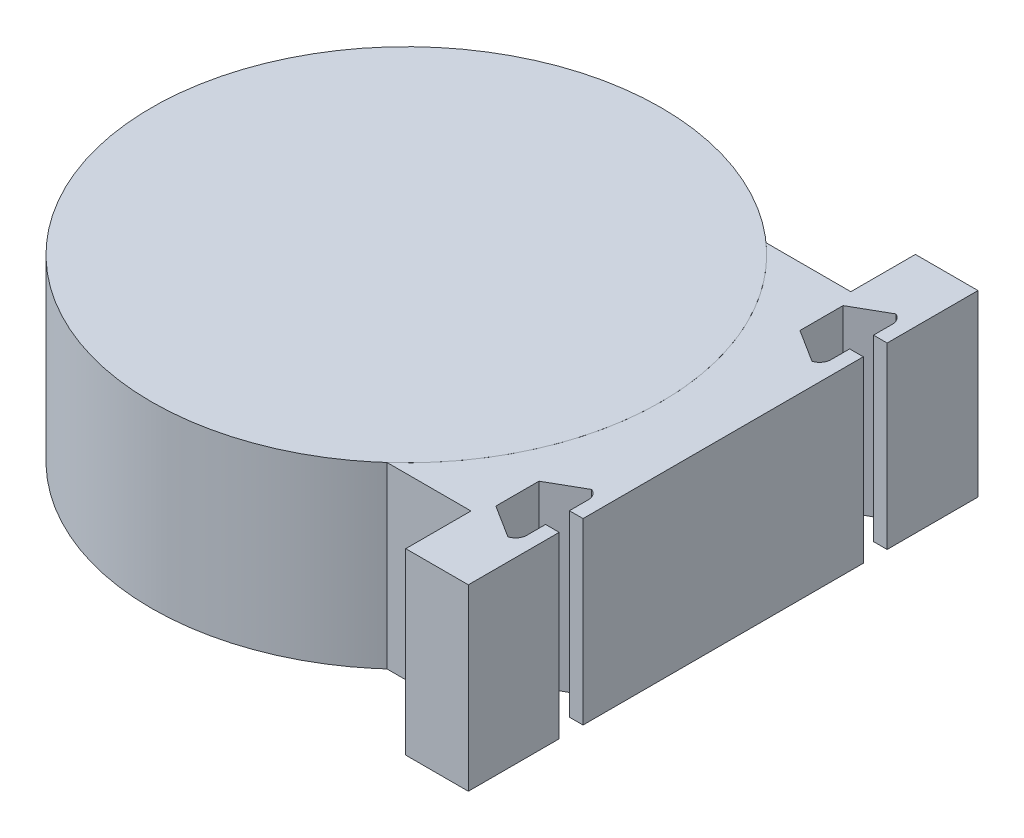
ISO-10303-21;
HEADER;
FILE_DESCRIPTION(('STEP AP214'),'2;1');
FILE_NAME('part.step','',(''),(''),'','','');
FILE_SCHEMA(('AUTOMOTIVE_DESIGN { 1 0 10303 214 1 1 1 1 }'));
ENDSEC;
DATA;
#1=APPLICATION_CONTEXT('core data for automotive mechanical design processes');
#2=APPLICATION_PROTOCOL_DEFINITION('international standard','automotive_design',2000,#1);
#3=PRODUCT_CONTEXT('',#1,'mechanical');
#4=PRODUCT('Part','Part','',(#3));
#5=PRODUCT_RELATED_PRODUCT_CATEGORY('part','',(#4));
#6=PRODUCT_DEFINITION_FORMATION('','',#4);
#7=PRODUCT_DEFINITION_CONTEXT('part definition',#1,'design');
#8=PRODUCT_DEFINITION('design','',#6,#7);
#9=PRODUCT_DEFINITION_SHAPE('','',#8);
#10=(LENGTH_UNIT() NAMED_UNIT(*) SI_UNIT(.MILLI.,.METRE.));
#11=(NAMED_UNIT(*) PLANE_ANGLE_UNIT() SI_UNIT($,.RADIAN.));
#12=(NAMED_UNIT(*) SI_UNIT($,.STERADIAN.) SOLID_ANGLE_UNIT());
#13=UNCERTAINTY_MEASURE_WITH_UNIT(LENGTH_MEASURE(1.E-05),#10,'distance_accuracy_value','');
#14=(GEOMETRIC_REPRESENTATION_CONTEXT(3) GLOBAL_UNCERTAINTY_ASSIGNED_CONTEXT((#13)) GLOBAL_UNIT_ASSIGNED_CONTEXT((#10,
#11,#12)) REPRESENTATION_CONTEXT('',''));
#15=CARTESIAN_POINT('',(0.,0.,0.));
#16=DIRECTION('',(0.,0.,1.));
#17=DIRECTION('',(1.,0.,0.));
#18=AXIS2_PLACEMENT_3D('',#15,#16,#17);
#19=CARTESIAN_POINT('',(35.4331913817621,0.,0.));
#20=DIRECTION('',(-1.,0.,0.));
#21=DIRECTION('',(0.,0.,1.));
#22=AXIS2_PLACEMENT_3D('',#19,#20,#21);
#23=PLANE('',#22);
#24=DIRECTION('',(0.,0.,1.));
#25=VECTOR('',#24,1.);
#26=CARTESIAN_POINT('',(35.4331913817621,20.,0.));
#27=LINE('',#26,#25);
#28=CARTESIAN_POINT('',(35.4331913817621,20.,-28.5));
#29=VERTEX_POINT('',#28);
#30=CARTESIAN_POINT('',(35.4331913817621,20.,-18.338));
#31=VERTEX_POINT('',#30);
#32=EDGE_CURVE('E255',#29,#31,#27,.T.);
#33=ORIENTED_EDGE('',*,*,#32,.T.);
#34=DIRECTION('',(0.,-1.,0.));
#35=VECTOR('',#34,1.);
#36=CARTESIAN_POINT('',(35.4331913817621,20.,-18.338));
#37=LINE('',#36,#35);
#38=CARTESIAN_POINT('',(35.4331913817621,0.,-18.338));
#39=VERTEX_POINT('',#38);
#40=EDGE_CURVE('E474',#31,#39,#37,.T.);
#41=ORIENTED_EDGE('',*,*,#40,.T.);
#42=DIRECTION('',(0.,0.,1.));
#43=VECTOR('',#42,1.);
#44=CARTESIAN_POINT('',(35.4331913817621,0.,0.));
#45=LINE('',#44,#43);
#46=CARTESIAN_POINT('',(35.4331913817621,0.,-28.5));
#47=VERTEX_POINT('',#46);
#48=EDGE_CURVE('E371',#47,#39,#45,.T.);
#49=ORIENTED_EDGE('',*,*,#48,.F.);
#50=DIRECTION('',(0.,1.,0.));
#51=VECTOR('',#50,1.);
#52=CARTESIAN_POINT('',(35.4331913817621,0.,-28.5));
#53=LINE('',#52,#51);
#54=EDGE_CURVE('E277',#47,#29,#53,.T.);
#55=ORIENTED_EDGE('',*,*,#54,.T.);
#56=EDGE_LOOP('',(#33,#41,#49,#55));
#57=FACE_BOUND('',#56,.T.);
#58=ADVANCED_FACE('F45',(#57),#23,.F.);
#59=CARTESIAN_POINT('',(35.4331913817621,0.,-15.671));
#60=VERTEX_POINT('',#59);
#61=CARTESIAN_POINT('',(35.4331913817621,0.,15.671));
#62=VERTEX_POINT('',#61);
#63=EDGE_CURVE('E247',#60,#62,#45,.T.);
#64=ORIENTED_EDGE('',*,*,#63,.F.);
#65=DIRECTION('',(0.,-1.,0.));
#66=VECTOR('',#65,1.);
#67=CARTESIAN_POINT('',(35.4331913817621,20.,-15.671));
#68=LINE('',#67,#66);
#69=CARTESIAN_POINT('',(35.4331913817621,20.,-15.671));
#70=VERTEX_POINT('',#69);
#71=EDGE_CURVE('E233',#70,#60,#68,.T.);
#72=ORIENTED_EDGE('',*,*,#71,.F.);
#73=CARTESIAN_POINT('',(35.4331913817621,20.,15.671));
#74=VERTEX_POINT('',#73);
#75=EDGE_CURVE('E245',#70,#74,#27,.T.);
#76=ORIENTED_EDGE('',*,*,#75,.T.);
#77=DIRECTION('',(0.,-1.,0.));
#78=VECTOR('',#77,1.);
#79=CARTESIAN_POINT('',(35.4331913817621,20.,15.671));
#80=LINE('',#79,#78);
#81=EDGE_CURVE('E331',#74,#62,#80,.T.);
#82=ORIENTED_EDGE('',*,*,#81,.T.);
#83=EDGE_LOOP('',(#64,#72,#76,#82));
#84=FACE_BOUND('',#83,.T.);
#85=ADVANCED_FACE('F243',(#84),#23,.F.);
#86=CARTESIAN_POINT('',(0.,0.,0.));
#87=DIRECTION('',(0.,1.,0.));
#88=DIRECTION('',(0.,0.,1.));
#89=AXIS2_PLACEMENT_3D('',#86,#87,#88);
#90=CYLINDRICAL_SURFACE('',#89,28.5);
#91=CARTESIAN_POINT('',(0.,20.,0.));
#92=DIRECTION('',(0.,1.,0.));
#93=DIRECTION('',(0.,0.,1.));
#94=AXIS2_PLACEMENT_3D('',#91,#92,#93);
#95=CIRCLE('',#94,28.5);
#96=CARTESIAN_POINT('',(19.046990751406,20.,21.200522241583));
#97=VERTEX_POINT('',#96);
#98=CARTESIAN_POINT('',(18.9614552412498,20.,-21.2770584229607));
#99=VERTEX_POINT('',#98);
#100=EDGE_CURVE('E359',#97,#99,#95,.T.);
#101=ORIENTED_EDGE('',*,*,#100,.T.);
#102=DIRECTION('',(0.,1.,0.));
#103=VECTOR('',#102,1.);
#104=CARTESIAN_POINT('',(18.9614552412498,0.,-21.2770584229607));
#105=LINE('',#104,#103);
#106=CARTESIAN_POINT('',(18.9614552412498,0.,-21.2770584229607));
#107=VERTEX_POINT('',#106);
#108=EDGE_CURVE('E270',#107,#99,#105,.T.);
#109=ORIENTED_EDGE('',*,*,#108,.F.);
#110=CARTESIAN_POINT('',(0.,0.,0.));
#111=DIRECTION('',(0.,1.,0.));
#112=DIRECTION('',(0.,0.,1.));
#113=AXIS2_PLACEMENT_3D('',#110,#111,#112);
#114=CIRCLE('',#113,28.5);
#115=CARTESIAN_POINT('',(19.046990751406,0.,21.200522241583));
#116=VERTEX_POINT('',#115);
#117=EDGE_CURVE('E269',#116,#107,#114,.T.);
#118=ORIENTED_EDGE('',*,*,#117,.F.);
#119=DIRECTION('',(0.,1.,0.));
#120=VECTOR('',#119,1.);
#121=CARTESIAN_POINT('',(19.046990751406,0.,21.200522241583));
#122=LINE('',#121,#120);
#123=EDGE_CURVE('E287',#116,#97,#122,.T.);
#124=ORIENTED_EDGE('',*,*,#123,.T.);
#125=EDGE_LOOP('',(#101,#109,#118,#124));
#126=FACE_BOUND('',#125,.T.);
#127=ADVANCED_FACE('F399',(#126),#90,.F.);
#128=CARTESIAN_POINT('',(0.,0.,-21.2770584229607));
#129=DIRECTION('',(0.,0.,-1.));
#130=DIRECTION('',(-1.,0.,0.));
#131=AXIS2_PLACEMENT_3D('',#128,#129,#130);
#132=PLANE('',#131);
#133=DIRECTION('',(-1.,0.,0.));
#134=VECTOR('',#133,1.);
#135=CARTESIAN_POINT('',(0.,20.,-21.2770584229607));
#136=LINE('',#135,#134);
#137=CARTESIAN_POINT('',(28.4331913817621,20.,-21.2770584229607));
#138=VERTEX_POINT('',#137);
#139=EDGE_CURVE('E266',#138,#99,#136,.T.);
#140=ORIENTED_EDGE('',*,*,#139,.F.);
#141=DIRECTION('',(0.,1.,0.));
#142=VECTOR('',#141,1.);
#143=CARTESIAN_POINT('',(28.4331913817621,0.,-21.2770584229607));
#144=LINE('',#143,#142);
#145=CARTESIAN_POINT('',(28.4331913817621,0.,-21.2770584229607));
#146=VERTEX_POINT('',#145);
#147=EDGE_CURVE('E273',#146,#138,#144,.T.);
#148=ORIENTED_EDGE('',*,*,#147,.F.);
#149=DIRECTION('',(-1.,0.,0.));
#150=VECTOR('',#149,1.);
#151=CARTESIAN_POINT('',(0.,0.,-21.2770584229607));
#152=LINE('',#151,#150);
#153=EDGE_CURVE('E290',#146,#107,#152,.T.);
#154=ORIENTED_EDGE('',*,*,#153,.T.);
#155=ORIENTED_EDGE('',*,*,#108,.T.);
#156=EDGE_LOOP('',(#140,#148,#154,#155));
#157=FACE_BOUND('',#156,.T.);
#158=ADVANCED_FACE('F393',(#157),#132,.T.);
#159=CARTESIAN_POINT('',(28.4331913817621,0.,0.));
#160=DIRECTION('',(-1.,0.,0.));
#161=DIRECTION('',(0.,0.,1.));
#162=AXIS2_PLACEMENT_3D('',#159,#160,#161);
#163=PLANE('',#162);
#164=DIRECTION('',(0.,0.,1.));
#165=VECTOR('',#164,1.);
#166=CARTESIAN_POINT('',(28.4331913817621,20.,0.));
#167=LINE('',#166,#165);
#168=CARTESIAN_POINT('',(28.4331913817621,20.,-28.5));
#169=VERTEX_POINT('',#168);
#170=EDGE_CURVE('E265',#169,#138,#167,.T.);
#171=ORIENTED_EDGE('',*,*,#170,.F.);
#172=DIRECTION('',(0.,1.,0.));
#173=VECTOR('',#172,1.);
#174=CARTESIAN_POINT('',(28.4331913817621,0.,-28.5));
#175=LINE('',#174,#173);
#176=CARTESIAN_POINT('',(28.4331913817621,0.,-28.5));
#177=VERTEX_POINT('',#176);
#178=EDGE_CURVE('E275',#177,#169,#175,.T.);
#179=ORIENTED_EDGE('',*,*,#178,.F.);
#180=DIRECTION('',(0.,0.,1.));
#181=VECTOR('',#180,1.);
#182=CARTESIAN_POINT('',(28.4331913817621,0.,0.));
#183=LINE('',#182,#181);
#184=EDGE_CURVE('E367',#177,#146,#183,.T.);
#185=ORIENTED_EDGE('',*,*,#184,.T.);
#186=ORIENTED_EDGE('',*,*,#147,.T.);
#187=EDGE_LOOP('',(#171,#179,#185,#186));
#188=FACE_BOUND('',#187,.T.);
#189=ADVANCED_FACE('F516',(#188),#163,.T.);
#190=CARTESIAN_POINT('',(0.,0.,-28.5));
#191=DIRECTION('',(0.,0.,1.));
#192=DIRECTION('',(1.,0.,0.));
#193=AXIS2_PLACEMENT_3D('',#190,#191,#192);
#194=PLANE('',#193);
#195=DIRECTION('',(1.,0.,0.));
#196=VECTOR('',#195,1.);
#197=CARTESIAN_POINT('',(0.,20.,-28.5));
#198=LINE('',#197,#196);
#199=EDGE_CURVE('E259',#169,#29,#198,.T.);
#200=ORIENTED_EDGE('',*,*,#199,.T.);
#201=ORIENTED_EDGE('',*,*,#54,.F.);
#202=DIRECTION('',(1.,0.,0.));
#203=VECTOR('',#202,1.);
#204=CARTESIAN_POINT('',(0.,0.,-28.5));
#205=LINE('',#204,#203);
#206=EDGE_CURVE('E373',#177,#47,#205,.T.);
#207=ORIENTED_EDGE('',*,*,#206,.F.);
#208=ORIENTED_EDGE('',*,*,#178,.T.);
#209=EDGE_LOOP('',(#200,#201,#207,#208));
#210=FACE_BOUND('',#209,.T.);
#211=ADVANCED_FACE('F514',(#210),#194,.F.);
#212=CARTESIAN_POINT('',(35.4331913817621,0.,18.338));
#213=VERTEX_POINT('',#212);
#214=CARTESIAN_POINT('',(35.4331913817621,0.,28.5));
#215=VERTEX_POINT('',#214);
#216=EDGE_CURVE('E370',#213,#215,#45,.T.);
#217=ORIENTED_EDGE('',*,*,#216,.F.);
#218=DIRECTION('',(0.,-1.,0.));
#219=VECTOR('',#218,1.);
#220=CARTESIAN_POINT('',(35.4331913817621,20.,18.338));
#221=LINE('',#220,#219);
#222=CARTESIAN_POINT('',(35.4331913817621,20.,18.338));
#223=VERTEX_POINT('',#222);
#224=EDGE_CURVE('E345',#223,#213,#221,.T.);
#225=ORIENTED_EDGE('',*,*,#224,.F.);
#226=CARTESIAN_POINT('',(35.4331913817621,20.,28.5));
#227=VERTEX_POINT('',#226);
#228=EDGE_CURVE('E256',#223,#227,#27,.T.);
#229=ORIENTED_EDGE('',*,*,#228,.T.);
#230=DIRECTION('',(0.,1.,0.));
#231=VECTOR('',#230,1.);
#232=CARTESIAN_POINT('',(35.4331913817621,0.,28.5));
#233=LINE('',#232,#231);
#234=EDGE_CURVE('E280',#215,#227,#233,.T.);
#235=ORIENTED_EDGE('',*,*,#234,.F.);
#236=EDGE_LOOP('',(#217,#225,#229,#235));
#237=FACE_BOUND('',#236,.T.);
#238=ADVANCED_FACE('F418',(#237),#23,.F.);
#239=CARTESIAN_POINT('',(0.,0.,28.5));
#240=DIRECTION('',(0.,0.,1.));
#241=DIRECTION('',(1.,0.,0.));
#242=AXIS2_PLACEMENT_3D('',#239,#240,#241);
#243=PLANE('',#242);
#244=DIRECTION('',(1.,0.,0.));
#245=VECTOR('',#244,1.);
#246=CARTESIAN_POINT('',(0.,20.,28.5));
#247=LINE('',#246,#245);
#248=CARTESIAN_POINT('',(28.4331913817621,20.,28.5));
#249=VERTEX_POINT('',#248);
#250=EDGE_CURVE('E260',#249,#227,#247,.T.);
#251=ORIENTED_EDGE('',*,*,#250,.F.);
#252=DIRECTION('',(0.,1.,0.));
#253=VECTOR('',#252,1.);
#254=CARTESIAN_POINT('',(28.4331913817621,0.,28.5));
#255=LINE('',#254,#253);
#256=CARTESIAN_POINT('',(28.4331913817621,0.,28.5));
#257=VERTEX_POINT('',#256);
#258=EDGE_CURVE('E283',#257,#249,#255,.T.);
#259=ORIENTED_EDGE('',*,*,#258,.F.);
#260=DIRECTION('',(1.,0.,0.));
#261=VECTOR('',#260,1.);
#262=CARTESIAN_POINT('',(0.,0.,28.5));
#263=LINE('',#262,#261);
#264=EDGE_CURVE('E366',#257,#215,#263,.T.);
#265=ORIENTED_EDGE('',*,*,#264,.T.);
#266=ORIENTED_EDGE('',*,*,#234,.T.);
#267=EDGE_LOOP('',(#251,#259,#265,#266));
#268=FACE_BOUND('',#267,.T.);
#269=ADVANCED_FACE('F409',(#268),#243,.T.);
#270=CARTESIAN_POINT('',(28.4331913817621,20.,21.200522241583));
#271=VERTEX_POINT('',#270);
#272=EDGE_CURVE('E380',#271,#249,#167,.T.);
#273=ORIENTED_EDGE('',*,*,#272,.F.);
#274=DIRECTION('',(0.,1.,0.));
#275=VECTOR('',#274,1.);
#276=CARTESIAN_POINT('',(28.4331913817621,0.,21.200522241583));
#277=LINE('',#276,#275);
#278=CARTESIAN_POINT('',(28.4331913817621,0.,21.200522241583));
#279=VERTEX_POINT('',#278);
#280=EDGE_CURVE('E285',#279,#271,#277,.T.);
#281=ORIENTED_EDGE('',*,*,#280,.F.);
#282=EDGE_CURVE('E363',#279,#257,#183,.T.);
#283=ORIENTED_EDGE('',*,*,#282,.T.);
#284=ORIENTED_EDGE('',*,*,#258,.T.);
#285=EDGE_LOOP('',(#273,#281,#283,#284));
#286=FACE_BOUND('',#285,.T.);
#287=ADVANCED_FACE('F403',(#286),#163,.T.);
#288=CARTESIAN_POINT('',(0.,0.,21.200522241583));
#289=DIRECTION('',(0.,0.,-1.));
#290=DIRECTION('',(-1.,0.,0.));
#291=AXIS2_PLACEMENT_3D('',#288,#289,#290);
#292=PLANE('',#291);
#293=DIRECTION('',(-1.,0.,0.));
#294=VECTOR('',#293,1.);
#295=CARTESIAN_POINT('',(0.,20.,21.200522241583));
#296=LINE('',#295,#294);
#297=EDGE_CURVE('E379',#271,#97,#296,.T.);
#298=ORIENTED_EDGE('',*,*,#297,.T.);
#299=ORIENTED_EDGE('',*,*,#123,.F.);
#300=DIRECTION('',(-1.,0.,0.));
#301=VECTOR('',#300,1.);
#302=CARTESIAN_POINT('',(0.,0.,21.200522241583));
#303=LINE('',#302,#301);
#304=EDGE_CURVE('E361',#279,#116,#303,.T.);
#305=ORIENTED_EDGE('',*,*,#304,.F.);
#306=ORIENTED_EDGE('',*,*,#280,.T.);
#307=EDGE_LOOP('',(#298,#299,#305,#306));
#308=FACE_BOUND('',#307,.T.);
#309=ADVANCED_FACE('F517',(#308),#292,.F.);
#310=CARTESIAN_POINT('',(0.,0.,0.));
#311=DIRECTION('',(0.,1.,0.));
#312=DIRECTION('',(0.,0.,1.));
#313=AXIS2_PLACEMENT_3D('',#310,#311,#312);
#314=PLANE('',#313);
#315=ORIENTED_EDGE('',*,*,#48,.T.);
#316=DIRECTION('',(1.,0.,0.));
#317=VECTOR('',#316,1.);
#318=CARTESIAN_POINT('',(33.9091913817621,0.,-18.338));
#319=LINE('',#318,#317);
#320=CARTESIAN_POINT('',(33.9091913817621,0.,-18.338));
#321=VERTEX_POINT('',#320);
#322=EDGE_CURVE('E239',#321,#39,#319,.T.);
#323=ORIENTED_EDGE('',*,*,#322,.F.);
#324=DIRECTION('',(0.,0.,1.));
#325=VECTOR('',#324,1.);
#326=CARTESIAN_POINT('',(33.9091913817621,0.,-21.64));
#327=LINE('',#326,#325);
#328=CARTESIAN_POINT('',(33.9091913817621,0.,-20.4546186460821));
#329=VERTEX_POINT('',#328);
#330=EDGE_CURVE('E471',#329,#321,#327,.T.);
#331=ORIENTED_EDGE('',*,*,#330,.F.);
#332=CARTESIAN_POINT('',(32.6391913817621,0.,-20.4546186460821));
#333=DIRECTION('',(0.,1.,0.));
#334=DIRECTION('',(0.,0.,1.));
#335=AXIS2_PLACEMENT_3D('',#332,#333,#334);
#336=CIRCLE('',#335,1.27);
#337=CARTESIAN_POINT('',(33.0950104750257,0.,-21.64));
#338=VERTEX_POINT('',#337);
#339=EDGE_CURVE('E299',#329,#338,#336,.T.);
#340=ORIENTED_EDGE('',*,*,#339,.T.);
#341=DIRECTION('',(0.868214773496011,0.,-0.496188580162089));
#342=VECTOR('',#341,1.);
#343=CARTESIAN_POINT('',(29.34605908307,0.,-19.4974577108601));
#344=LINE('',#343,#342);
#345=CARTESIAN_POINT('',(29.34605908307,0.,-19.4974577108601));
#346=VERTEX_POINT('',#345);
#347=EDGE_CURVE('E468',#346,#338,#344,.T.);
#348=ORIENTED_EDGE('',*,*,#347,.F.);
#349=DIRECTION('',(0.,0.,-1.));
#350=VECTOR('',#349,1.);
#351=CARTESIAN_POINT('',(29.34605908307,0.,-14.6714577108601));
#352=LINE('',#351,#350);
#353=CARTESIAN_POINT('',(29.34605908307,0.,-14.6714577108601));
#354=VERTEX_POINT('',#353);
#355=EDGE_CURVE('E465',#354,#346,#352,.T.);
#356=ORIENTED_EDGE('',*,*,#355,.F.);
#357=DIRECTION('',(-0.84597460686771,0.,-0.533223184543792));
#358=VECTOR('',#357,1.);
#359=CARTESIAN_POINT('',(32.9989774355247,0.,-12.369));
#360=LINE('',#359,#358);
#361=CARTESIAN_POINT('',(32.9989774355247,0.,-12.369));
#362=VERTEX_POINT('',#361);
#363=EDGE_CURVE('E458',#362,#354,#360,.T.);
#364=ORIENTED_EDGE('',*,*,#363,.F.);
#365=CARTESIAN_POINT('',(32.6391913817621,0.,-13.5869712621888));
#366=DIRECTION('',(0.,1.,0.));
#367=DIRECTION('',(0.,0.,1.));
#368=AXIS2_PLACEMENT_3D('',#365,#366,#367);
#369=CIRCLE('',#368,1.27);
#370=CARTESIAN_POINT('',(33.9091913817621,0.,-13.5869712621888));
#371=VERTEX_POINT('',#370);
#372=EDGE_CURVE('E303',#362,#371,#369,.T.);
#373=ORIENTED_EDGE('',*,*,#372,.T.);
#374=DIRECTION('',(0.,0.,1.));
#375=VECTOR('',#374,1.);
#376=CARTESIAN_POINT('',(33.9091913817621,0.,-15.671));
#377=LINE('',#376,#375);
#378=CARTESIAN_POINT('',(33.9091913817621,0.,-15.671));
#379=VERTEX_POINT('',#378);
#380=EDGE_CURVE('E456',#379,#371,#377,.T.);
#381=ORIENTED_EDGE('',*,*,#380,.F.);
#382=DIRECTION('',(-1.,0.,0.));
#383=VECTOR('',#382,1.);
#384=CARTESIAN_POINT('',(35.4331913817621,0.,-15.671));
#385=LINE('',#384,#383);
#386=EDGE_CURVE('E454',#60,#379,#385,.T.);
#387=ORIENTED_EDGE('',*,*,#386,.F.);
#388=ORIENTED_EDGE('',*,*,#63,.T.);
#389=DIRECTION('',(-1.,0.,0.));
#390=VECTOR('',#389,1.);
#391=CARTESIAN_POINT('',(0.,0.,15.671));
#392=LINE('',#391,#390);
#393=CARTESIAN_POINT('',(33.9091913817621,0.,15.671));
#394=VERTEX_POINT('',#393);
#395=EDGE_CURVE('E357',#62,#394,#392,.T.);
#396=ORIENTED_EDGE('',*,*,#395,.T.);
#397=DIRECTION('',(0.,0.,-1.));
#398=VECTOR('',#397,1.);
#399=CARTESIAN_POINT('',(33.9091913817621,0.,0.));
#400=LINE('',#399,#398);
#401=CARTESIAN_POINT('',(33.9091913817621,0.,13.5543813539179));
#402=VERTEX_POINT('',#401);
#403=EDGE_CURVE('E319',#394,#402,#400,.T.);
#404=ORIENTED_EDGE('',*,*,#403,.T.);
#405=CARTESIAN_POINT('',(32.6391913817621,0.,13.5543813539179));
#406=DIRECTION('',(0.,1.,0.));
#407=DIRECTION('',(0.,0.,1.));
#408=AXIS2_PLACEMENT_3D('',#405,#406,#407);
#409=CIRCLE('',#408,1.27);
#410=CARTESIAN_POINT('',(33.0950104750257,0.,12.369));
#411=VERTEX_POINT('',#410);
#412=EDGE_CURVE('E53',#402,#411,#409,.T.);
#413=ORIENTED_EDGE('',*,*,#412,.T.);
#414=DIRECTION('',(-0.868214773496011,0.,0.49618858016209));
#415=VECTOR('',#414,1.);
#416=CARTESIAN_POINT('',(13.4766380331124,0.,23.5809865547171));
#417=LINE('',#416,#415);
#418=CARTESIAN_POINT('',(29.34605908307,0.,14.5115422891399));
#419=VERTEX_POINT('',#418);
#420=EDGE_CURVE('E317',#411,#419,#417,.T.);
#421=ORIENTED_EDGE('',*,*,#420,.T.);
#422=DIRECTION('',(0.,0.,1.));
#423=VECTOR('',#422,1.);
#424=CARTESIAN_POINT('',(29.34605908307,0.,0.));
#425=LINE('',#424,#423);
#426=CARTESIAN_POINT('',(29.34605908307,0.,19.3375422891399));
#427=VERTEX_POINT('',#426);
#428=EDGE_CURVE('E326',#419,#427,#425,.T.);
#429=ORIENTED_EDGE('',*,*,#428,.T.);
#430=DIRECTION('',(0.84597460686771,0.,0.533223184543793));
#431=VECTOR('',#430,1.);
#432=CARTESIAN_POINT('',(-0.37915936056536,0.,0.601547720151972));
#433=LINE('',#432,#431);
#434=CARTESIAN_POINT('',(32.9989774355247,0.,21.64));
#435=VERTEX_POINT('',#434);
#436=EDGE_CURVE('E352',#427,#435,#433,.T.);
#437=ORIENTED_EDGE('',*,*,#436,.T.);
#438=CARTESIAN_POINT('',(32.6391913817621,0.,20.4220287378111));
#439=DIRECTION('',(0.,1.,0.));
#440=DIRECTION('',(0.,0.,1.));
#441=AXIS2_PLACEMENT_3D('',#438,#439,#440);
#442=CIRCLE('',#441,1.27);
#443=CARTESIAN_POINT('',(33.9091913817621,0.,20.4220287378111));
#444=VERTEX_POINT('',#443);
#445=EDGE_CURVE('E307',#435,#444,#442,.T.);
#446=ORIENTED_EDGE('',*,*,#445,.T.);
#447=DIRECTION('',(0.,0.,-1.));
#448=VECTOR('',#447,1.);
#449=CARTESIAN_POINT('',(33.9091913817621,0.,0.));
#450=LINE('',#449,#448);
#451=CARTESIAN_POINT('',(33.9091913817621,0.,18.338));
#452=VERTEX_POINT('',#451);
#453=EDGE_CURVE('E350',#444,#452,#450,.T.);
#454=ORIENTED_EDGE('',*,*,#453,.T.);
#455=DIRECTION('',(1.,0.,0.));
#456=VECTOR('',#455,1.);
#457=CARTESIAN_POINT('',(0.,0.,18.338));
#458=LINE('',#457,#456);
#459=EDGE_CURVE('E347',#452,#213,#458,.T.);
#460=ORIENTED_EDGE('',*,*,#459,.T.);
#461=ORIENTED_EDGE('',*,*,#216,.T.);
#462=ORIENTED_EDGE('',*,*,#264,.F.);
#463=ORIENTED_EDGE('',*,*,#282,.F.);
#464=ORIENTED_EDGE('',*,*,#304,.T.);
#465=ORIENTED_EDGE('',*,*,#117,.T.);
#466=ORIENTED_EDGE('',*,*,#153,.F.);
#467=ORIENTED_EDGE('',*,*,#184,.F.);
#468=ORIENTED_EDGE('',*,*,#206,.T.);
#469=EDGE_LOOP('',(#315,#323,#331,#340,#348,#356,#364,#373,#381,#387,#388,#396,#404,#413,#421,
#429,#437,#446,#454,#460,#461,#462,#463,#464,#465,#466,#467,#468));
#470=FACE_BOUND('',#469,.T.);
#471=ADVANCED_FACE('F315',(#470),#314,.F.);
#472=CARTESIAN_POINT('',(0.,20.,0.));
#473=DIRECTION('',(0.,1.,0.));
#474=DIRECTION('',(0.,0.,1.));
#475=AXIS2_PLACEMENT_3D('',#472,#473,#474);
#476=PLANE('',#475);
#477=DIRECTION('',(1.,0.,0.));
#478=VECTOR('',#477,1.);
#479=CARTESIAN_POINT('',(33.9091913817621,20.,-18.338));
#480=LINE('',#479,#478);
#481=CARTESIAN_POINT('',(33.9091913817621,20.,-18.338));
#482=VERTEX_POINT('',#481);
#483=EDGE_CURVE('E248',#482,#31,#480,.T.);
#484=ORIENTED_EDGE('',*,*,#483,.T.);
#485=ORIENTED_EDGE('',*,*,#32,.F.);
#486=ORIENTED_EDGE('',*,*,#199,.F.);
#487=ORIENTED_EDGE('',*,*,#170,.T.);
#488=ORIENTED_EDGE('',*,*,#139,.T.);
#489=ORIENTED_EDGE('',*,*,#100,.F.);
#490=ORIENTED_EDGE('',*,*,#297,.F.);
#491=ORIENTED_EDGE('',*,*,#272,.T.);
#492=ORIENTED_EDGE('',*,*,#250,.T.);
#493=ORIENTED_EDGE('',*,*,#228,.F.);
#494=DIRECTION('',(-1.,0.,0.));
#495=VECTOR('',#494,1.);
#496=CARTESIAN_POINT('',(35.4331913817621,20.,18.338));
#497=LINE('',#496,#495);
#498=CARTESIAN_POINT('',(33.9091913817621,20.,18.338));
#499=VERTEX_POINT('',#498);
#500=EDGE_CURVE('E414',#223,#499,#497,.T.);
#501=ORIENTED_EDGE('',*,*,#500,.T.);
#502=DIRECTION('',(0.,0.,1.));
#503=VECTOR('',#502,1.);
#504=CARTESIAN_POINT('',(33.9091913817621,20.,18.338));
#505=LINE('',#504,#503);
#506=CARTESIAN_POINT('',(33.9091913817621,20.,20.4220287378111));
#507=VERTEX_POINT('',#506);
#508=EDGE_CURVE('E435',#499,#507,#505,.T.);
#509=ORIENTED_EDGE('',*,*,#508,.T.);
#510=CARTESIAN_POINT('',(32.6391913817621,20.,20.4220287378111));
#511=DIRECTION('',(0.,1.,0.));
#512=DIRECTION('',(0.,0.,1.));
#513=AXIS2_PLACEMENT_3D('',#510,#511,#512);
#514=CIRCLE('',#513,1.27);
#515=CARTESIAN_POINT('',(32.9989774355247,20.,21.64));
#516=VERTEX_POINT('',#515);
#517=EDGE_CURVE('E309',#507,#516,#514,.F.);
#518=ORIENTED_EDGE('',*,*,#517,.T.);
#519=DIRECTION('',(-0.84597460686771,0.,-0.533223184543793));
#520=VECTOR('',#519,1.);
#521=CARTESIAN_POINT('',(32.9989774355247,20.,21.64));
#522=LINE('',#521,#520);
#523=CARTESIAN_POINT('',(29.34605908307,20.,19.3375422891399));
#524=VERTEX_POINT('',#523);
#525=EDGE_CURVE('E434',#516,#524,#522,.T.);
#526=ORIENTED_EDGE('',*,*,#525,.T.);
#527=DIRECTION('',(0.,0.,-1.));
#528=VECTOR('',#527,1.);
#529=CARTESIAN_POINT('',(29.34605908307,20.,19.3375422891399));
#530=LINE('',#529,#528);
#531=CARTESIAN_POINT('',(29.34605908307,20.,14.5115422891399));
#532=VERTEX_POINT('',#531);
#533=EDGE_CURVE('E439',#524,#532,#530,.T.);
#534=ORIENTED_EDGE('',*,*,#533,.T.);
#535=DIRECTION('',(0.868214773496011,0.,-0.49618858016209));
#536=VECTOR('',#535,1.);
#537=CARTESIAN_POINT('',(29.34605908307,20.,14.5115422891399));
#538=LINE('',#537,#536);
#539=CARTESIAN_POINT('',(33.0950104750257,20.,12.369));
#540=VERTEX_POINT('',#539);
#541=EDGE_CURVE('E441',#532,#540,#538,.T.);
#542=ORIENTED_EDGE('',*,*,#541,.T.);
#543=CARTESIAN_POINT('',(32.6391913817621,20.,13.5543813539179));
#544=DIRECTION('',(0.,1.,0.));
#545=DIRECTION('',(0.,0.,1.));
#546=AXIS2_PLACEMENT_3D('',#543,#544,#545);
#547=CIRCLE('',#546,1.27);
#548=CARTESIAN_POINT('',(33.9091913817621,20.,13.5543813539179));
#549=VERTEX_POINT('',#548);
#550=EDGE_CURVE('E12',#540,#549,#547,.F.);
#551=ORIENTED_EDGE('',*,*,#550,.T.);
#552=DIRECTION('',(0.,0.,1.));
#553=VECTOR('',#552,1.);
#554=CARTESIAN_POINT('',(33.9091913817621,20.,12.369));
#555=LINE('',#554,#553);
#556=CARTESIAN_POINT('',(33.9091913817621,20.,15.671));
#557=VERTEX_POINT('',#556);
#558=EDGE_CURVE('E447',#549,#557,#555,.T.);
#559=ORIENTED_EDGE('',*,*,#558,.T.);
#560=DIRECTION('',(1.,0.,0.));
#561=VECTOR('',#560,1.);
#562=CARTESIAN_POINT('',(33.9091913817621,20.,15.671));
#563=LINE('',#562,#561);
#564=EDGE_CURVE('E254',#557,#74,#563,.T.);
#565=ORIENTED_EDGE('',*,*,#564,.T.);
#566=ORIENTED_EDGE('',*,*,#75,.F.);
#567=DIRECTION('',(-1.,0.,0.));
#568=VECTOR('',#567,1.);
#569=CARTESIAN_POINT('',(35.4331913817621,20.,-15.671));
#570=LINE('',#569,#568);
#571=CARTESIAN_POINT('',(33.9091913817621,20.,-15.671));
#572=VERTEX_POINT('',#571);
#573=EDGE_CURVE('E229',#70,#572,#570,.T.);
#574=ORIENTED_EDGE('',*,*,#573,.T.);
#575=DIRECTION('',(0.,0.,1.));
#576=VECTOR('',#575,1.);
#577=CARTESIAN_POINT('',(33.9091913817621,20.,-15.671));
#578=LINE('',#577,#576);
#579=CARTESIAN_POINT('',(33.9091913817621,20.,-13.5869712621888));
#580=VERTEX_POINT('',#579);
#581=EDGE_CURVE('E238',#572,#580,#578,.T.);
#582=ORIENTED_EDGE('',*,*,#581,.T.);
#583=CARTESIAN_POINT('',(32.6391913817621,20.,-13.5869712621888));
#584=DIRECTION('',(0.,1.,0.));
#585=DIRECTION('',(0.,0.,1.));
#586=AXIS2_PLACEMENT_3D('',#583,#584,#585);
#587=CIRCLE('',#586,1.27);
#588=CARTESIAN_POINT('',(32.9989774355247,20.,-12.369));
#589=VERTEX_POINT('',#588);
#590=EDGE_CURVE('E305',#580,#589,#587,.F.);
#591=ORIENTED_EDGE('',*,*,#590,.T.);
#592=DIRECTION('',(-0.84597460686771,0.,-0.533223184543792));
#593=VECTOR('',#592,1.);
#594=CARTESIAN_POINT('',(32.9989774355247,20.,-12.369));
#595=LINE('',#594,#593);
#596=CARTESIAN_POINT('',(29.34605908307,20.,-14.6714577108601));
#597=VERTEX_POINT('',#596);
#598=EDGE_CURVE('E494',#589,#597,#595,.T.);
#599=ORIENTED_EDGE('',*,*,#598,.T.);
#600=DIRECTION('',(0.,0.,-1.));
#601=VECTOR('',#600,1.);
#602=CARTESIAN_POINT('',(29.34605908307,20.,-14.6714577108601));
#603=LINE('',#602,#601);
#604=CARTESIAN_POINT('',(29.34605908307,20.,-19.4974577108601));
#605=VERTEX_POINT('',#604);
#606=EDGE_CURVE('E497',#597,#605,#603,.T.);
#607=ORIENTED_EDGE('',*,*,#606,.T.);
#608=DIRECTION('',(0.868214773496011,0.,-0.496188580162089));
#609=VECTOR('',#608,1.);
#610=CARTESIAN_POINT('',(29.34605908307,20.,-19.4974577108601));
#611=LINE('',#610,#609);
#612=CARTESIAN_POINT('',(33.0950104750257,20.,-21.64));
#613=VERTEX_POINT('',#612);
#614=EDGE_CURVE('E502',#605,#613,#611,.T.);
#615=ORIENTED_EDGE('',*,*,#614,.T.);
#616=CARTESIAN_POINT('',(32.6391913817621,20.,-20.4546186460821));
#617=DIRECTION('',(0.,1.,0.));
#618=DIRECTION('',(0.,0.,1.));
#619=AXIS2_PLACEMENT_3D('',#616,#617,#618);
#620=CIRCLE('',#619,1.27);
#621=CARTESIAN_POINT('',(33.9091913817621,20.,-20.4546186460821));
#622=VERTEX_POINT('',#621);
#623=EDGE_CURVE('E301',#613,#622,#620,.F.);
#624=ORIENTED_EDGE('',*,*,#623,.T.);
#625=DIRECTION('',(0.,0.,1.));
#626=VECTOR('',#625,1.);
#627=CARTESIAN_POINT('',(33.9091913817621,20.,-21.64));
#628=LINE('',#627,#626);
#629=EDGE_CURVE('E504',#622,#482,#628,.T.);
#630=ORIENTED_EDGE('',*,*,#629,.T.);
#631=EDGE_LOOP('',(#484,#485,#486,#487,#488,#489,#490,#491,#492,#493,#501,#509,#518,#526,#534,
#542,#551,#559,#565,#566,#574,#582,#591,#599,#607,#615,#624,#630));
#632=FACE_BOUND('',#631,.T.);
#633=ADVANCED_FACE('F252',(#632),#476,.T.);
#634=CARTESIAN_POINT('',(33.9091913817621,20.,15.671));
#635=DIRECTION('',(0.,0.,-1.));
#636=DIRECTION('',(-1.,0.,0.));
#637=AXIS2_PLACEMENT_3D('',#634,#635,#636);
#638=PLANE('',#637);
#639=ORIENTED_EDGE('',*,*,#81,.F.);
#640=ORIENTED_EDGE('',*,*,#564,.F.);
#641=DIRECTION('',(0.,-1.,0.));
#642=VECTOR('',#641,1.);
#643=CARTESIAN_POINT('',(33.9091913817621,20.,15.671));
#644=LINE('',#643,#642);
#645=EDGE_CURVE('E328',#557,#394,#644,.T.);
#646=ORIENTED_EDGE('',*,*,#645,.T.);
#647=ORIENTED_EDGE('',*,*,#395,.F.);
#648=EDGE_LOOP('',(#639,#640,#646,#647));
#649=FACE_BOUND('',#648,.T.);
#650=ADVANCED_FACE('F451',(#649),#638,.F.);
#651=CARTESIAN_POINT('',(33.9091913817621,20.,12.369));
#652=DIRECTION('',(1.,0.,0.));
#653=DIRECTION('',(0.,0.,-1.));
#654=AXIS2_PLACEMENT_3D('',#651,#652,#653);
#655=PLANE('',#654);
#656=ORIENTED_EDGE('',*,*,#558,.F.);
#657=DIRECTION('',(0.,1.,0.));
#658=VECTOR('',#657,1.);
#659=CARTESIAN_POINT('',(33.9091913817621,20.,13.5543813539179));
#660=LINE('',#659,#658);
#661=EDGE_CURVE('E297',#549,#402,#660,.F.);
#662=ORIENTED_EDGE('',*,*,#661,.T.);
#663=ORIENTED_EDGE('',*,*,#403,.F.);
#664=ORIENTED_EDGE('',*,*,#645,.F.);
#665=EDGE_LOOP('',(#656,#662,#663,#664));
#666=FACE_BOUND('',#665,.T.);
#667=ADVANCED_FACE('F560',(#666),#655,.F.);
#668=CARTESIAN_POINT('',(29.34605908307,20.,14.5115422891399));
#669=DIRECTION('',(-0.49618858016209,0.,-0.868214773496011));
#670=DIRECTION('',(-0.868214773496011,0.,0.49618858016209));
#671=AXIS2_PLACEMENT_3D('',#668,#669,#670);
#672=PLANE('',#671);
#673=DIRECTION('',(0.,-1.,0.));
#674=VECTOR('',#673,1.);
#675=CARTESIAN_POINT('',(33.0950104750257,20.,12.369));
#676=LINE('',#675,#674);
#677=EDGE_CURVE('E324',#540,#411,#676,.T.);
#678=ORIENTED_EDGE('',*,*,#677,.F.);
#679=ORIENTED_EDGE('',*,*,#541,.F.);
#680=DIRECTION('',(0.,-1.,0.));
#681=VECTOR('',#680,1.);
#682=CARTESIAN_POINT('',(29.34605908307,20.,14.5115422891399));
#683=LINE('',#682,#681);
#684=EDGE_CURVE('E325',#532,#419,#683,.T.);
#685=ORIENTED_EDGE('',*,*,#684,.T.);
#686=ORIENTED_EDGE('',*,*,#420,.F.);
#687=EDGE_LOOP('',(#678,#679,#685,#686));
#688=FACE_BOUND('',#687,.T.);
#689=ADVANCED_FACE('F322',(#688),#672,.F.);
#690=CARTESIAN_POINT('',(29.34605908307,20.,19.3375422891399));
#691=DIRECTION('',(-1.,0.,0.));
#692=DIRECTION('',(0.,0.,1.));
#693=AXIS2_PLACEMENT_3D('',#690,#691,#692);
#694=PLANE('',#693);
#695=ORIENTED_EDGE('',*,*,#684,.F.);
#696=ORIENTED_EDGE('',*,*,#533,.F.);
#697=DIRECTION('',(0.,-1.,0.));
#698=VECTOR('',#697,1.);
#699=CARTESIAN_POINT('',(29.34605908307,20.,19.3375422891399));
#700=LINE('',#699,#698);
#701=EDGE_CURVE('E333',#524,#427,#700,.T.);
#702=ORIENTED_EDGE('',*,*,#701,.T.);
#703=ORIENTED_EDGE('',*,*,#428,.F.);
#704=EDGE_LOOP('',(#695,#696,#702,#703));
#705=FACE_BOUND('',#704,.T.);
#706=ADVANCED_FACE('F554',(#705),#694,.F.);
#707=CARTESIAN_POINT('',(32.9989774355247,20.,21.64));
#708=DIRECTION('',(-0.533223184543793,0.,0.84597460686771));
#709=DIRECTION('',(0.84597460686771,0.,0.533223184543793));
#710=AXIS2_PLACEMENT_3D('',#707,#708,#709);
#711=PLANE('',#710);
#712=ORIENTED_EDGE('',*,*,#701,.F.);
#713=ORIENTED_EDGE('',*,*,#525,.F.);
#714=DIRECTION('',(0.,-1.,0.));
#715=VECTOR('',#714,1.);
#716=CARTESIAN_POINT('',(32.9989774355247,20.,21.64));
#717=LINE('',#716,#715);
#718=EDGE_CURVE('E339',#516,#435,#717,.T.);
#719=ORIENTED_EDGE('',*,*,#718,.T.);
#720=ORIENTED_EDGE('',*,*,#436,.F.);
#721=EDGE_LOOP('',(#712,#713,#719,#720));
#722=FACE_BOUND('',#721,.T.);
#723=ADVANCED_FACE('F437',(#722),#711,.F.);
#724=CARTESIAN_POINT('',(33.9091913817621,20.,18.338));
#725=DIRECTION('',(1.,0.,0.));
#726=DIRECTION('',(0.,0.,-1.));
#727=AXIS2_PLACEMENT_3D('',#724,#725,#726);
#728=PLANE('',#727);
#729=ORIENTED_EDGE('',*,*,#453,.F.);
#730=DIRECTION('',(0.,-1.,0.));
#731=VECTOR('',#730,1.);
#732=CARTESIAN_POINT('',(33.9091913817621,20.,20.4220287378111));
#733=LINE('',#732,#731);
#734=EDGE_CURVE('E295',#444,#507,#733,.F.);
#735=ORIENTED_EDGE('',*,*,#734,.T.);
#736=ORIENTED_EDGE('',*,*,#508,.F.);
#737=DIRECTION('',(0.,-1.,0.));
#738=VECTOR('',#737,1.);
#739=CARTESIAN_POINT('',(33.9091913817621,20.,18.338));
#740=LINE('',#739,#738);
#741=EDGE_CURVE('E342',#499,#452,#740,.T.);
#742=ORIENTED_EDGE('',*,*,#741,.T.);
#743=EDGE_LOOP('',(#729,#735,#736,#742));
#744=FACE_BOUND('',#743,.T.);
#745=ADVANCED_FACE('F426',(#744),#728,.F.);
#746=CARTESIAN_POINT('',(35.4331913817621,20.,18.338));
#747=DIRECTION('',(0.,0.,1.));
#748=DIRECTION('',(1.,0.,0.));
#749=AXIS2_PLACEMENT_3D('',#746,#747,#748);
#750=PLANE('',#749);
#751=ORIENTED_EDGE('',*,*,#741,.F.);
#752=ORIENTED_EDGE('',*,*,#500,.F.);
#753=ORIENTED_EDGE('',*,*,#224,.T.);
#754=ORIENTED_EDGE('',*,*,#459,.F.);
#755=EDGE_LOOP('',(#751,#752,#753,#754));
#756=FACE_BOUND('',#755,.T.);
#757=ADVANCED_FACE('F422',(#756),#750,.F.);
#758=CARTESIAN_POINT('',(33.9091913817621,20.,-18.338));
#759=DIRECTION('',(0.,0.,-1.));
#760=DIRECTION('',(-1.,0.,0.));
#761=AXIS2_PLACEMENT_3D('',#758,#759,#760);
#762=PLANE('',#761);
#763=ORIENTED_EDGE('',*,*,#322,.T.);
#764=ORIENTED_EDGE('',*,*,#40,.F.);
#765=ORIENTED_EDGE('',*,*,#483,.F.);
#766=DIRECTION('',(0.,-1.,0.));
#767=VECTOR('',#766,1.);
#768=CARTESIAN_POINT('',(33.9091913817621,20.,-18.338));
#769=LINE('',#768,#767);
#770=EDGE_CURVE('E477',#482,#321,#769,.T.);
#771=ORIENTED_EDGE('',*,*,#770,.T.);
#772=EDGE_LOOP('',(#763,#764,#765,#771));
#773=FACE_BOUND('',#772,.T.);
#774=ADVANCED_FACE('F549',(#773),#762,.F.);
#775=CARTESIAN_POINT('',(33.9091913817621,20.,-21.64));
#776=DIRECTION('',(1.,0.,0.));
#777=DIRECTION('',(0.,0.,-1.));
#778=AXIS2_PLACEMENT_3D('',#775,#776,#777);
#779=PLANE('',#778);
#780=ORIENTED_EDGE('',*,*,#629,.F.);
#781=DIRECTION('',(0.,1.,0.));
#782=VECTOR('',#781,1.);
#783=CARTESIAN_POINT('',(33.9091913817621,20.,-20.4546186460821));
#784=LINE('',#783,#782);
#785=EDGE_CURVE('E272',#622,#329,#784,.F.);
#786=ORIENTED_EDGE('',*,*,#785,.T.);
#787=ORIENTED_EDGE('',*,*,#330,.T.);
#788=ORIENTED_EDGE('',*,*,#770,.F.);
#789=EDGE_LOOP('',(#780,#786,#787,#788));
#790=FACE_BOUND('',#789,.T.);
#791=ADVANCED_FACE('F582',(#790),#779,.F.);
#792=CARTESIAN_POINT('',(29.34605908307,20.,-19.4974577108601));
#793=DIRECTION('',(-0.496188580162089,0.,-0.868214773496011));
#794=DIRECTION('',(-0.868214773496011,0.,0.496188580162089));
#795=AXIS2_PLACEMENT_3D('',#792,#793,#794);
#796=PLANE('',#795);
#797=ORIENTED_EDGE('',*,*,#347,.T.);
#798=DIRECTION('',(0.,-1.,0.));
#799=VECTOR('',#798,1.);
#800=CARTESIAN_POINT('',(33.0950104750257,20.,-21.64));
#801=LINE('',#800,#799);
#802=EDGE_CURVE('E480',#613,#338,#801,.T.);
#803=ORIENTED_EDGE('',*,*,#802,.F.);
#804=ORIENTED_EDGE('',*,*,#614,.F.);
#805=DIRECTION('',(0.,-1.,0.));
#806=VECTOR('',#805,1.);
#807=CARTESIAN_POINT('',(29.34605908307,20.,-19.4974577108601));
#808=LINE('',#807,#806);
#809=EDGE_CURVE('E483',#605,#346,#808,.T.);
#810=ORIENTED_EDGE('',*,*,#809,.T.);
#811=EDGE_LOOP('',(#797,#803,#804,#810));
#812=FACE_BOUND('',#811,.T.);
#813=ADVANCED_FACE('F578',(#812),#796,.F.);
#814=CARTESIAN_POINT('',(29.34605908307,20.,-14.6714577108601));
#815=DIRECTION('',(-1.,0.,0.));
#816=DIRECTION('',(0.,0.,1.));
#817=AXIS2_PLACEMENT_3D('',#814,#815,#816);
#818=PLANE('',#817);
#819=ORIENTED_EDGE('',*,*,#355,.T.);
#820=ORIENTED_EDGE('',*,*,#809,.F.);
#821=ORIENTED_EDGE('',*,*,#606,.F.);
#822=DIRECTION('',(0.,-1.,0.));
#823=VECTOR('',#822,1.);
#824=CARTESIAN_POINT('',(29.34605908307,20.,-14.6714577108601));
#825=LINE('',#824,#823);
#826=EDGE_CURVE('E485',#597,#354,#825,.T.);
#827=ORIENTED_EDGE('',*,*,#826,.T.);
#828=EDGE_LOOP('',(#819,#820,#821,#827));
#829=FACE_BOUND('',#828,.T.);
#830=ADVANCED_FACE('F574',(#829),#818,.F.);
#831=CARTESIAN_POINT('',(32.9989774355247,20.,-12.369));
#832=DIRECTION('',(-0.533223184543792,0.,0.84597460686771));
#833=DIRECTION('',(0.84597460686771,0.,0.533223184543792));
#834=AXIS2_PLACEMENT_3D('',#831,#832,#833);
#835=PLANE('',#834);
#836=ORIENTED_EDGE('',*,*,#363,.T.);
#837=ORIENTED_EDGE('',*,*,#826,.F.);
#838=ORIENTED_EDGE('',*,*,#598,.F.);
#839=DIRECTION('',(0.,-1.,0.));
#840=VECTOR('',#839,1.);
#841=CARTESIAN_POINT('',(32.9989774355247,20.,-12.369));
#842=LINE('',#841,#840);
#843=EDGE_CURVE('E487',#589,#362,#842,.T.);
#844=ORIENTED_EDGE('',*,*,#843,.T.);
#845=EDGE_LOOP('',(#836,#837,#838,#844));
#846=FACE_BOUND('',#845,.T.);
#847=ADVANCED_FACE('F571',(#846),#835,.F.);
#848=CARTESIAN_POINT('',(33.9091913817621,20.,-15.671));
#849=DIRECTION('',(1.,0.,0.));
#850=DIRECTION('',(0.,0.,-1.));
#851=AXIS2_PLACEMENT_3D('',#848,#849,#850);
#852=PLANE('',#851);
#853=ORIENTED_EDGE('',*,*,#380,.T.);
#854=DIRECTION('',(0.,-1.,0.));
#855=VECTOR('',#854,1.);
#856=CARTESIAN_POINT('',(33.9091913817621,20.,-13.5869712621888));
#857=LINE('',#856,#855);
#858=EDGE_CURVE('E293',#371,#580,#857,.F.);
#859=ORIENTED_EDGE('',*,*,#858,.T.);
#860=ORIENTED_EDGE('',*,*,#581,.F.);
#861=DIRECTION('',(0.,-1.,0.));
#862=VECTOR('',#861,1.);
#863=CARTESIAN_POINT('',(33.9091913817621,20.,-15.671));
#864=LINE('',#863,#862);
#865=EDGE_CURVE('E235',#572,#379,#864,.T.);
#866=ORIENTED_EDGE('',*,*,#865,.T.);
#867=EDGE_LOOP('',(#853,#859,#860,#866));
#868=FACE_BOUND('',#867,.T.);
#869=ADVANCED_FACE('F491',(#868),#852,.F.);
#870=CARTESIAN_POINT('',(35.4331913817621,20.,-15.671));
#871=DIRECTION('',(0.,0.,1.));
#872=DIRECTION('',(1.,0.,0.));
#873=AXIS2_PLACEMENT_3D('',#870,#871,#872);
#874=PLANE('',#873);
#875=ORIENTED_EDGE('',*,*,#386,.T.);
#876=ORIENTED_EDGE('',*,*,#865,.F.);
#877=ORIENTED_EDGE('',*,*,#573,.F.);
#878=ORIENTED_EDGE('',*,*,#71,.T.);
#879=EDGE_LOOP('',(#875,#876,#877,#878));
#880=FACE_BOUND('',#879,.T.);
#881=ADVANCED_FACE('F232',(#880),#874,.F.);
#882=CARTESIAN_POINT('',(32.6391913817621,20.,-20.4546186460821));
#883=DIRECTION('',(0.,1.,0.));
#884=DIRECTION('',(0.,0.,1.));
#885=AXIS2_PLACEMENT_3D('',#882,#883,#884);
#886=CYLINDRICAL_SURFACE('',#885,1.27);
#887=ORIENTED_EDGE('',*,*,#623,.F.);
#888=ORIENTED_EDGE('',*,*,#802,.T.);
#889=ORIENTED_EDGE('',*,*,#339,.F.);
#890=ORIENTED_EDGE('',*,*,#785,.F.);
#891=EDGE_LOOP('',(#887,#888,#889,#890));
#892=FACE_BOUND('',#891,.T.);
#893=ADVANCED_FACE('F568',(#892),#886,.F.);
#894=CARTESIAN_POINT('',(32.6391913817621,20.,-13.5869712621888));
#895=DIRECTION('',(0.,-1.,0.));
#896=DIRECTION('',(0.,0.,-1.));
#897=AXIS2_PLACEMENT_3D('',#894,#895,#896);
#898=CYLINDRICAL_SURFACE('',#897,1.27);
#899=ORIENTED_EDGE('',*,*,#590,.F.);
#900=ORIENTED_EDGE('',*,*,#858,.F.);
#901=ORIENTED_EDGE('',*,*,#372,.F.);
#902=ORIENTED_EDGE('',*,*,#843,.F.);
#903=EDGE_LOOP('',(#899,#900,#901,#902));
#904=FACE_BOUND('',#903,.T.);
#905=ADVANCED_FACE('F603',(#904),#898,.F.);
#906=CARTESIAN_POINT('',(32.6391913817621,20.,20.4220287378111));
#907=DIRECTION('',(0.,-1.,0.));
#908=DIRECTION('',(0.,0.,-1.));
#909=AXIS2_PLACEMENT_3D('',#906,#907,#908);
#910=CYLINDRICAL_SURFACE('',#909,1.27);
#911=ORIENTED_EDGE('',*,*,#517,.F.);
#912=ORIENTED_EDGE('',*,*,#734,.F.);
#913=ORIENTED_EDGE('',*,*,#445,.F.);
#914=ORIENTED_EDGE('',*,*,#718,.F.);
#915=EDGE_LOOP('',(#911,#912,#913,#914));
#916=FACE_BOUND('',#915,.T.);
#917=ADVANCED_FACE('F429',(#916),#910,.F.);
#918=CARTESIAN_POINT('',(32.6391913817621,20.,13.5543813539179));
#919=DIRECTION('',(0.,1.,0.));
#920=DIRECTION('',(0.,0.,1.));
#921=AXIS2_PLACEMENT_3D('',#918,#919,#920);
#922=CYLINDRICAL_SURFACE('',#921,1.27);
#923=ORIENTED_EDGE('',*,*,#550,.F.);
#924=ORIENTED_EDGE('',*,*,#677,.T.);
#925=ORIENTED_EDGE('',*,*,#412,.F.);
#926=ORIENTED_EDGE('',*,*,#661,.F.);
#927=EDGE_LOOP('',(#923,#924,#925,#926));
#928=FACE_BOUND('',#927,.T.);
#929=ADVANCED_FACE('F47',(#928),#922,.F.);
#930=CLOSED_SHELL('',(#58,#85,#127,#158,#189,#211,#238,#269,#287,#309,#471,#633,#650,#667,#689,
#706,#723,#745,#757,#774,#791,#813,#830,#847,#869,#881,#893,#905,#917,#929));
#931=MANIFOLD_SOLID_BREP('B2',#930);
#932=CARTESIAN_POINT('',(0.,20.,0.));
#933=DIRECTION('',(0.,-1.,0.));
#934=DIRECTION('',(0.,0.,-1.));
#935=AXIS2_PLACEMENT_3D('',#932,#933,#934);
#936=CYLINDRICAL_SURFACE('',#935,28.5);
#937=CARTESIAN_POINT('',(0.,20.,0.));
#938=DIRECTION('',(0.,1.,0.));
#939=DIRECTION('',(0.,0.,1.));
#940=AXIS2_PLACEMENT_3D('',#937,#938,#939);
#941=CIRCLE('',#940,28.5);
#942=CARTESIAN_POINT('',(0.,20.,28.5));
#943=VERTEX_POINT('',#942);
#944=EDGE_CURVE('E44',#943,#943,#941,.T.);
#945=ORIENTED_EDGE('',*,*,#944,.F.);
#946=EDGE_LOOP('',(#945));
#947=FACE_BOUND('',#946,.T.);
#948=CARTESIAN_POINT('',(0.,0.,0.));
#949=DIRECTION('',(0.,1.,0.));
#950=DIRECTION('',(0.,0.,1.));
#951=AXIS2_PLACEMENT_3D('',#948,#949,#950);
#952=CIRCLE('',#951,28.5);
#953=CARTESIAN_POINT('',(0.,0.,28.5));
#954=VERTEX_POINT('',#953);
#955=EDGE_CURVE('E813',#954,#954,#952,.T.);
#956=ORIENTED_EDGE('',*,*,#955,.T.);
#957=EDGE_LOOP('',(#956));
#958=FACE_BOUND('',#957,.T.);
#959=ADVANCED_FACE('F810',(#947,#958),#936,.T.);
#960=CARTESIAN_POINT('',(0.,20.,0.));
#961=DIRECTION('',(0.,1.,0.));
#962=DIRECTION('',(0.,0.,1.));
#963=AXIS2_PLACEMENT_3D('',#960,#961,#962);
#964=PLANE('',#963);
#965=ORIENTED_EDGE('',*,*,#944,.T.);
#966=EDGE_LOOP('',(#965));
#967=FACE_BOUND('',#966,.T.);
#968=ADVANCED_FACE('F825',(#967),#964,.T.);
#969=CARTESIAN_POINT('',(0.,0.,0.));
#970=DIRECTION('',(0.,1.,0.));
#971=DIRECTION('',(0.,0.,1.));
#972=AXIS2_PLACEMENT_3D('',#969,#970,#971);
#973=PLANE('',#972);
#974=ORIENTED_EDGE('',*,*,#955,.F.);
#975=EDGE_LOOP('',(#974));
#976=FACE_BOUND('',#975,.T.);
#977=ADVANCED_FACE('F823',(#976),#973,.F.);
#978=CLOSED_SHELL('',(#959,#968,#977));
#979=MANIFOLD_SOLID_BREP('B6',#978);
#980=ADVANCED_BREP_SHAPE_REPRESENTATION('',(#18,#931,#979),#14);
#981=SHAPE_DEFINITION_REPRESENTATION(#9,#980);
ENDSEC;
END-ISO-10303-21;
